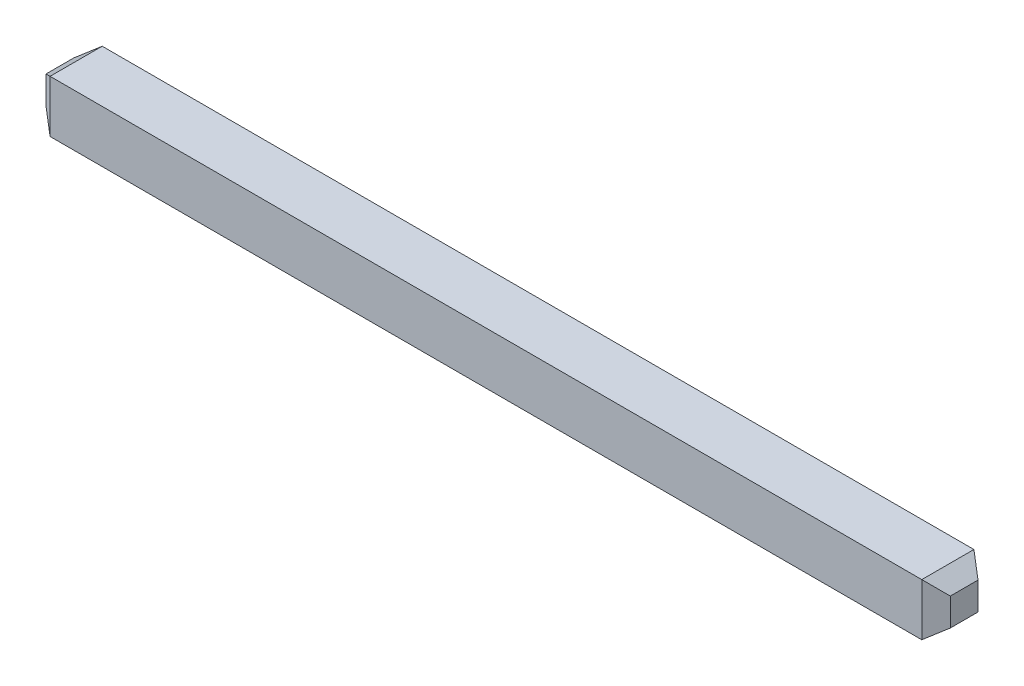
ISO-10303-21;
HEADER;
FILE_DESCRIPTION(('STEP AP214'),'2;1');
FILE_NAME('part.step','',(''),(''),'','','');
FILE_SCHEMA(('AUTOMOTIVE_DESIGN { 1 0 10303 214 1 1 1 1 }'));
ENDSEC;
DATA;
#1=APPLICATION_CONTEXT('core data for automotive mechanical design processes');
#2=APPLICATION_PROTOCOL_DEFINITION('international standard','automotive_design',2000,#1);
#3=PRODUCT_CONTEXT('',#1,'mechanical');
#4=PRODUCT('Part','Part','',(#3));
#5=PRODUCT_RELATED_PRODUCT_CATEGORY('part','',(#4));
#6=PRODUCT_DEFINITION_FORMATION('','',#4);
#7=PRODUCT_DEFINITION_CONTEXT('part definition',#1,'design');
#8=PRODUCT_DEFINITION('design','',#6,#7);
#9=PRODUCT_DEFINITION_SHAPE('','',#8);
#10=(LENGTH_UNIT() NAMED_UNIT(*) SI_UNIT(.MILLI.,.METRE.));
#11=(NAMED_UNIT(*) PLANE_ANGLE_UNIT() SI_UNIT($,.RADIAN.));
#12=(NAMED_UNIT(*) SI_UNIT($,.STERADIAN.) SOLID_ANGLE_UNIT());
#13=UNCERTAINTY_MEASURE_WITH_UNIT(LENGTH_MEASURE(1.E-05),#10,'distance_accuracy_value','');
#14=(GEOMETRIC_REPRESENTATION_CONTEXT(3) GLOBAL_UNCERTAINTY_ASSIGNED_CONTEXT((#13)) GLOBAL_UNIT_ASSIGNED_CONTEXT((#10,
#11,#12)) REPRESENTATION_CONTEXT('',''));
#15=CARTESIAN_POINT('',(0.,0.,0.));
#16=DIRECTION('',(0.,0.,1.));
#17=DIRECTION('',(1.,0.,0.));
#18=AXIS2_PLACEMENT_3D('',#15,#16,#17);
#19=CARTESIAN_POINT('',(-2.4,3.525,-44.45));
#20=DIRECTION('',(0.6,0.8,0.));
#21=DIRECTION('',(-0.8,0.6,0.));
#22=AXIS2_PLACEMENT_3D('',#19,#20,#21);
#23=PLANE('',#22);
#24=DIRECTION('',(0.,0.,1.));
#25=VECTOR('',#24,1.);
#26=CARTESIAN_POINT('',(-2.3,3.45,-44.45));
#27=LINE('',#26,#25);
#28=CARTESIAN_POINT('',(-2.29999999999978,3.45,-44.7699999999997));
#29=VERTEX_POINT('',#28);
#30=CARTESIAN_POINT('',(-2.29999999999978,3.45,-44.1300000000003));
#31=VERTEX_POINT('',#30);
#32=EDGE_CURVE('E105',#29,#31,#27,.T.);
#33=ORIENTED_EDGE('',*,*,#32,.T.);
#34=DIRECTION('',(0.685994340575993,-0.514495755427534,0.514495755419576));
#35=VECTOR('',#34,1.);
#36=CARTESIAN_POINT('',(-2.50000000000087,3.6,-44.2799999999988));
#37=LINE('',#36,#35);
#38=CARTESIAN_POINT('',(-2.50000000000022,3.6,-44.2799999999997));
#39=VERTEX_POINT('',#38);
#40=EDGE_CURVE('E92',#39,#31,#37,.T.);
#41=ORIENTED_EDGE('',*,*,#40,.F.);
#42=DIRECTION('',(0.,0.,-1.));
#43=VECTOR('',#42,1.);
#44=CARTESIAN_POINT('',(-2.5,3.6,-44.45));
#45=LINE('',#44,#43);
#46=CARTESIAN_POINT('',(-2.50000000000043,3.6,-44.6200000000006));
#47=VERTEX_POINT('',#46);
#48=EDGE_CURVE('E79',#39,#47,#45,.T.);
#49=ORIENTED_EDGE('',*,*,#48,.T.);
#50=DIRECTION('',(0.685994340575995,-0.514495755427521,-0.514495755419586));
#51=VECTOR('',#50,1.);
#52=CARTESIAN_POINT('',(-2.50000000000087,3.6,-44.6200000000012));
#53=LINE('',#52,#51);
#54=EDGE_CURVE('E20',#47,#29,#53,.T.);
#55=ORIENTED_EDGE('',*,*,#54,.T.);
#56=EDGE_LOOP('',(#33,#41,#49,#55));
#57=FACE_BOUND('',#56,.T.);
#58=ADVANCED_FACE('F17',(#57),#23,.F.);
#59=CARTESIAN_POINT('',(8.5,3.525,-44.45));
#60=DIRECTION('',(-0.6,0.8,0.));
#61=DIRECTION('',(-0.8,-0.6,0.));
#62=AXIS2_PLACEMENT_3D('',#59,#60,#61);
#63=PLANE('',#62);
#64=DIRECTION('',(0.,0.,-1.));
#65=VECTOR('',#64,1.);
#66=CARTESIAN_POINT('',(8.6,3.6,-44.45));
#67=LINE('',#66,#65);
#68=CARTESIAN_POINT('',(8.60000000000043,3.6,-44.2799999999994));
#69=VERTEX_POINT('',#68);
#70=CARTESIAN_POINT('',(8.60000000000022,3.6,-44.6200000000003));
#71=VERTEX_POINT('',#70);
#72=EDGE_CURVE('E114',#69,#71,#67,.T.);
#73=ORIENTED_EDGE('',*,*,#72,.F.);
#74=DIRECTION('',(0.685994340575992,0.514495755427534,-0.514495755419576));
#75=VECTOR('',#74,1.);
#76=CARTESIAN_POINT('',(8.39999999999913,3.45,-44.1300000000012));
#77=LINE('',#76,#75);
#78=CARTESIAN_POINT('',(8.39999999999989,3.45,-44.1300000000002));
#79=VERTEX_POINT('',#78);
#80=EDGE_CURVE('E109',#79,#69,#77,.T.);
#81=ORIENTED_EDGE('',*,*,#80,.F.);
#82=DIRECTION('',(0.,0.,1.));
#83=VECTOR('',#82,1.);
#84=CARTESIAN_POINT('',(8.4,3.45,-44.45));
#85=LINE('',#84,#83);
#86=CARTESIAN_POINT('',(8.39999999999978,3.45,-44.7699999999997));
#87=VERTEX_POINT('',#86);
#88=EDGE_CURVE('E103',#79,#87,#85,.F.);
#89=ORIENTED_EDGE('',*,*,#88,.T.);
#90=DIRECTION('',(0.685994340575993,0.514495755427522,0.514495755419587));
#91=VECTOR('',#90,1.);
#92=CARTESIAN_POINT('',(8.39999999999913,3.45,-44.7699999999988));
#93=LINE('',#92,#91);
#94=EDGE_CURVE('E107',#87,#71,#93,.T.);
#95=ORIENTED_EDGE('',*,*,#94,.T.);
#96=EDGE_LOOP('',(#73,#81,#89,#95));
#97=FACE_BOUND('',#96,.T.);
#98=ADVANCED_FACE('F175',(#97),#63,.F.);
#99=CARTESIAN_POINT('',(-2.4,3.77,-44.695));
#100=DIRECTION('',(0.599999999990736,0.,0.800000000006948));
#101=DIRECTION('',(0.800000000006948,0.,-0.599999999990736));
#102=AXIS2_PLACEMENT_3D('',#99,#100,#101);
#103=PLANE('',#102);
#104=DIRECTION('',(0.,1.,0.));
#105=VECTOR('',#104,1.);
#106=CARTESIAN_POINT('',(-2.3,3.77,-44.77));
#107=LINE('',#106,#105);
#108=CARTESIAN_POINT('',(-2.29999999999956,4.09,-44.7699999999994));
#109=VERTEX_POINT('',#108);
#110=EDGE_CURVE('E88',#109,#29,#107,.F.);
#111=ORIENTED_EDGE('',*,*,#110,.T.);
#112=ORIENTED_EDGE('',*,*,#54,.F.);
#113=DIRECTION('',(0.,1.,0.));
#114=VECTOR('',#113,1.);
#115=CARTESIAN_POINT('',(-2.5,3.77,-44.62));
#116=LINE('',#115,#114);
#117=CARTESIAN_POINT('',(-2.50000000000043,3.94,-44.6200000000006));
#118=VERTEX_POINT('',#117);
#119=EDGE_CURVE('E85',#47,#118,#116,.T.);
#120=ORIENTED_EDGE('',*,*,#119,.T.);
#121=DIRECTION('',(-0.68599434057003,-0.514495755427522,0.514495755427537));
#122=VECTOR('',#121,1.);
#123=CARTESIAN_POINT('',(-2.3,4.09,-44.77));
#124=LINE('',#123,#122);
#125=EDGE_CURVE('E126',#109,#118,#124,.T.);
#126=ORIENTED_EDGE('',*,*,#125,.F.);
#127=EDGE_LOOP('',(#111,#112,#120,#126));
#128=FACE_BOUND('',#127,.T.);
#129=ADVANCED_FACE('F84',(#128),#103,.F.);
#130=CARTESIAN_POINT('',(-2.5,3.77,-44.45));
#131=DIRECTION('',(1.,0.,0.));
#132=DIRECTION('',(0.,0.,-1.));
#133=AXIS2_PLACEMENT_3D('',#130,#131,#132);
#134=PLANE('',#133);
#135=DIRECTION('',(0.,1.,0.));
#136=VECTOR('',#135,1.);
#137=CARTESIAN_POINT('',(-2.50000000000087,3.77,-44.2799999999988));
#138=LINE('',#137,#136);
#139=CARTESIAN_POINT('',(-2.50000000000022,3.94,-44.2799999999997));
#140=VERTEX_POINT('',#139);
#141=EDGE_CURVE('E94',#140,#39,#138,.F.);
#142=ORIENTED_EDGE('',*,*,#141,.F.);
#143=DIRECTION('',(0.,0.,1.));
#144=VECTOR('',#143,1.);
#145=CARTESIAN_POINT('',(-2.5,3.94,-44.45));
#146=LINE('',#145,#144);
#147=EDGE_CURVE('E98',#118,#140,#146,.T.);
#148=ORIENTED_EDGE('',*,*,#147,.F.);
#149=ORIENTED_EDGE('',*,*,#119,.F.);
#150=ORIENTED_EDGE('',*,*,#48,.F.);
#151=EDGE_LOOP('',(#142,#148,#149,#150));
#152=FACE_BOUND('',#151,.T.);
#153=ADVANCED_FACE('F96',(#152),#134,.F.);
#154=CARTESIAN_POINT('',(-2.4,3.77,-44.205));
#155=DIRECTION('',(-0.599999999990736,0.,0.800000000006948));
#156=DIRECTION('',(0.800000000006948,0.,0.599999999990736));
#157=AXIS2_PLACEMENT_3D('',#154,#155,#156);
#158=PLANE('',#157);
#159=ORIENTED_EDGE('',*,*,#40,.T.);
#160=DIRECTION('',(0.,1.,0.));
#161=VECTOR('',#160,1.);
#162=CARTESIAN_POINT('',(-2.3,3.77,-44.13));
#163=LINE('',#162,#161);
#164=CARTESIAN_POINT('',(-2.29999999999957,4.09,-44.1300000000006));
#165=VERTEX_POINT('',#164);
#166=EDGE_CURVE('E132',#165,#31,#163,.F.);
#167=ORIENTED_EDGE('',*,*,#166,.F.);
#168=DIRECTION('',(0.685994340570039,0.514495755427529,0.51449575542752));
#169=VECTOR('',#168,1.);
#170=CARTESIAN_POINT('',(-2.5,3.94,-44.28));
#171=LINE('',#170,#169);
#172=EDGE_CURVE('E129',#140,#165,#171,.T.);
#173=ORIENTED_EDGE('',*,*,#172,.F.);
#174=ORIENTED_EDGE('',*,*,#141,.T.);
#175=EDGE_LOOP('',(#159,#167,#173,#174));
#176=FACE_BOUND('',#175,.T.);
#177=ADVANCED_FACE('F186',(#176),#158,.T.);
#178=CARTESIAN_POINT('',(3.05,3.45,-44.45));
#179=DIRECTION('',(0.,1.,0.));
#180=DIRECTION('',(0.,0.,1.));
#181=AXIS2_PLACEMENT_3D('',#178,#179,#180);
#182=PLANE('',#181);
#183=ORIENTED_EDGE('',*,*,#32,.F.);
#184=DIRECTION('',(1.,0.,0.));
#185=VECTOR('',#184,1.);
#186=CARTESIAN_POINT('',(3.05,3.45,-44.77));
#187=LINE('',#186,#185);
#188=EDGE_CURVE('E123',#29,#87,#187,.T.);
#189=ORIENTED_EDGE('',*,*,#188,.T.);
#190=ORIENTED_EDGE('',*,*,#88,.F.);
#191=DIRECTION('',(1.,0.,0.));
#192=VECTOR('',#191,1.);
#193=CARTESIAN_POINT('',(3.05,3.45,-44.13));
#194=LINE('',#193,#192);
#195=EDGE_CURVE('E135',#31,#79,#194,.T.);
#196=ORIENTED_EDGE('',*,*,#195,.F.);
#197=EDGE_LOOP('',(#183,#189,#190,#196));
#198=FACE_BOUND('',#197,.T.);
#199=ADVANCED_FACE('F179',(#198),#182,.F.);
#200=CARTESIAN_POINT('',(8.5,3.77,-44.695));
#201=DIRECTION('',(-0.599999999990736,0.,0.800000000006948));
#202=DIRECTION('',(0.800000000006948,0.,0.599999999990736));
#203=AXIS2_PLACEMENT_3D('',#200,#201,#202);
#204=PLANE('',#203);
#205=DIRECTION('',(0.,1.,0.));
#206=VECTOR('',#205,1.);
#207=CARTESIAN_POINT('',(8.6,3.77,-44.62));
#208=LINE('',#207,#206);
#209=CARTESIAN_POINT('',(8.60000000000043,3.94,-44.6200000000006));
#210=VERTEX_POINT('',#209);
#211=EDGE_CURVE('E117',#71,#210,#208,.T.);
#212=ORIENTED_EDGE('',*,*,#211,.F.);
#213=ORIENTED_EDGE('',*,*,#94,.F.);
#214=DIRECTION('',(0.,1.,0.));
#215=VECTOR('',#214,1.);
#216=CARTESIAN_POINT('',(8.4,3.77,-44.77));
#217=LINE('',#216,#215);
#218=CARTESIAN_POINT('',(8.39999999999956,4.09,-44.7699999999994));
#219=VERTEX_POINT('',#218);
#220=EDGE_CURVE('E120',#87,#219,#217,.T.);
#221=ORIENTED_EDGE('',*,*,#220,.T.);
#222=DIRECTION('',(-0.685994340570029,0.514495755427522,-0.51449575542754));
#223=VECTOR('',#222,1.);
#224=CARTESIAN_POINT('',(8.6,3.94,-44.62));
#225=LINE('',#224,#223);
#226=EDGE_CURVE('E140',#210,#219,#225,.T.);
#227=ORIENTED_EDGE('',*,*,#226,.F.);
#228=EDGE_LOOP('',(#212,#213,#221,#227));
#229=FACE_BOUND('',#228,.T.);
#230=ADVANCED_FACE('F167',(#229),#204,.F.);
#231=CARTESIAN_POINT('',(8.5,3.77,-44.205));
#232=DIRECTION('',(0.599999999990736,0.,0.800000000006948));
#233=DIRECTION('',(0.800000000006948,0.,-0.599999999990736));
#234=AXIS2_PLACEMENT_3D('',#231,#232,#233);
#235=PLANE('',#234);
#236=DIRECTION('',(0.685994340570037,-0.514495755427528,-0.514495755427522));
#237=VECTOR('',#236,1.);
#238=CARTESIAN_POINT('',(8.4,4.09,-44.13));
#239=LINE('',#238,#237);
#240=CARTESIAN_POINT('',(8.39999999999957,4.09,-44.1300000000006));
#241=VERTEX_POINT('',#240);
#242=CARTESIAN_POINT('',(8.60000000000043,3.94,-44.2799999999994));
#243=VERTEX_POINT('',#242);
#244=EDGE_CURVE('E35',#241,#243,#239,.T.);
#245=ORIENTED_EDGE('',*,*,#244,.F.);
#246=DIRECTION('',(0.,1.,0.));
#247=VECTOR('',#246,1.);
#248=CARTESIAN_POINT('',(8.4,3.77,-44.13));
#249=LINE('',#248,#247);
#250=EDGE_CURVE('E138',#79,#241,#249,.T.);
#251=ORIENTED_EDGE('',*,*,#250,.F.);
#252=ORIENTED_EDGE('',*,*,#80,.T.);
#253=DIRECTION('',(0.,1.,0.));
#254=VECTOR('',#253,1.);
#255=CARTESIAN_POINT('',(8.6,3.77,-44.28));
#256=LINE('',#255,#254);
#257=EDGE_CURVE('E111',#243,#69,#256,.F.);
#258=ORIENTED_EDGE('',*,*,#257,.F.);
#259=EDGE_LOOP('',(#245,#251,#252,#258));
#260=FACE_BOUND('',#259,.T.);
#261=ADVANCED_FACE('F211',(#260),#235,.T.);
#262=CARTESIAN_POINT('',(8.6,3.77,-44.45));
#263=DIRECTION('',(1.,0.,0.));
#264=DIRECTION('',(0.,0.,-1.));
#265=AXIS2_PLACEMENT_3D('',#262,#263,#264);
#266=PLANE('',#265);
#267=ORIENTED_EDGE('',*,*,#211,.T.);
#268=DIRECTION('',(0.,0.,1.));
#269=VECTOR('',#268,1.);
#270=CARTESIAN_POINT('',(8.6,3.94,-44.45));
#271=LINE('',#270,#269);
#272=EDGE_CURVE('E144',#243,#210,#271,.F.);
#273=ORIENTED_EDGE('',*,*,#272,.F.);
#274=ORIENTED_EDGE('',*,*,#257,.T.);
#275=ORIENTED_EDGE('',*,*,#72,.T.);
#276=EDGE_LOOP('',(#267,#273,#274,#275));
#277=FACE_BOUND('',#276,.T.);
#278=ADVANCED_FACE('F172',(#277),#266,.T.);
#279=CARTESIAN_POINT('',(3.05,3.77,-44.77));
#280=DIRECTION('',(0.,0.,1.));
#281=DIRECTION('',(1.,0.,0.));
#282=AXIS2_PLACEMENT_3D('',#279,#280,#281);
#283=PLANE('',#282);
#284=ORIENTED_EDGE('',*,*,#110,.F.);
#285=DIRECTION('',(1.,0.,0.));
#286=VECTOR('',#285,1.);
#287=CARTESIAN_POINT('',(3.05,4.09,-44.77));
#288=LINE('',#287,#286);
#289=EDGE_CURVE('E147',#219,#109,#288,.F.);
#290=ORIENTED_EDGE('',*,*,#289,.F.);
#291=ORIENTED_EDGE('',*,*,#220,.F.);
#292=ORIENTED_EDGE('',*,*,#188,.F.);
#293=EDGE_LOOP('',(#284,#290,#291,#292));
#294=FACE_BOUND('',#293,.T.);
#295=ADVANCED_FACE('F181',(#294),#283,.F.);
#296=CARTESIAN_POINT('',(-2.4,4.015,-44.45));
#297=DIRECTION('',(-0.6,0.8,0.));
#298=DIRECTION('',(-0.8,-0.6,0.));
#299=AXIS2_PLACEMENT_3D('',#296,#297,#298);
#300=PLANE('',#299);
#301=ORIENTED_EDGE('',*,*,#172,.T.);
#302=DIRECTION('',(0.,0.,1.));
#303=VECTOR('',#302,1.);
#304=CARTESIAN_POINT('',(-2.3,4.09,-44.45));
#305=LINE('',#304,#303);
#306=EDGE_CURVE('E150',#109,#165,#305,.T.);
#307=ORIENTED_EDGE('',*,*,#306,.F.);
#308=ORIENTED_EDGE('',*,*,#125,.T.);
#309=ORIENTED_EDGE('',*,*,#147,.T.);
#310=EDGE_LOOP('',(#301,#307,#308,#309));
#311=FACE_BOUND('',#310,.T.);
#312=ADVANCED_FACE('F183',(#311),#300,.T.);
#313=CARTESIAN_POINT('',(3.05,3.77,-44.13));
#314=DIRECTION('',(0.,0.,1.));
#315=DIRECTION('',(1.,0.,0.));
#316=AXIS2_PLACEMENT_3D('',#313,#314,#315);
#317=PLANE('',#316);
#318=ORIENTED_EDGE('',*,*,#195,.T.);
#319=ORIENTED_EDGE('',*,*,#250,.T.);
#320=DIRECTION('',(1.,0.,0.));
#321=VECTOR('',#320,1.);
#322=CARTESIAN_POINT('',(3.05,4.09,-44.13));
#323=LINE('',#322,#321);
#324=EDGE_CURVE('E26',#165,#241,#323,.T.);
#325=ORIENTED_EDGE('',*,*,#324,.F.);
#326=ORIENTED_EDGE('',*,*,#166,.T.);
#327=EDGE_LOOP('',(#318,#319,#325,#326));
#328=FACE_BOUND('',#327,.T.);
#329=ADVANCED_FACE('F160',(#328),#317,.T.);
#330=CARTESIAN_POINT('',(8.5,4.015,-44.45));
#331=DIRECTION('',(0.6,0.8,0.));
#332=DIRECTION('',(-0.8,0.6,0.));
#333=AXIS2_PLACEMENT_3D('',#330,#331,#332);
#334=PLANE('',#333);
#335=ORIENTED_EDGE('',*,*,#244,.T.);
#336=ORIENTED_EDGE('',*,*,#272,.T.);
#337=ORIENTED_EDGE('',*,*,#226,.T.);
#338=DIRECTION('',(0.,0.,1.));
#339=VECTOR('',#338,1.);
#340=CARTESIAN_POINT('',(8.4,4.09,-44.45));
#341=LINE('',#340,#339);
#342=EDGE_CURVE('E11',#241,#219,#341,.F.);
#343=ORIENTED_EDGE('',*,*,#342,.F.);
#344=EDGE_LOOP('',(#335,#336,#337,#343));
#345=FACE_BOUND('',#344,.T.);
#346=ADVANCED_FACE('F163',(#345),#334,.T.);
#347=CARTESIAN_POINT('',(3.05,4.09,-44.45));
#348=DIRECTION('',(0.,1.,0.));
#349=DIRECTION('',(0.,0.,1.));
#350=AXIS2_PLACEMENT_3D('',#347,#348,#349);
#351=PLANE('',#350);
#352=ORIENTED_EDGE('',*,*,#324,.T.);
#353=ORIENTED_EDGE('',*,*,#342,.T.);
#354=ORIENTED_EDGE('',*,*,#289,.T.);
#355=ORIENTED_EDGE('',*,*,#306,.T.);
#356=EDGE_LOOP('',(#352,#353,#354,#355));
#357=FACE_BOUND('',#356,.T.);
#358=ADVANCED_FACE('F156',(#357),#351,.T.);
#359=CLOSED_SHELL('',(#58,#98,#129,#153,#177,#199,#230,#261,#278,#295,#312,#329,#346,#358));
#360=MANIFOLD_SOLID_BREP('B1',#359);
#361=ADVANCED_BREP_SHAPE_REPRESENTATION('',(#18,#360),#14);
#362=SHAPE_DEFINITION_REPRESENTATION(#9,#361);
ENDSEC;
END-ISO-10303-21;
